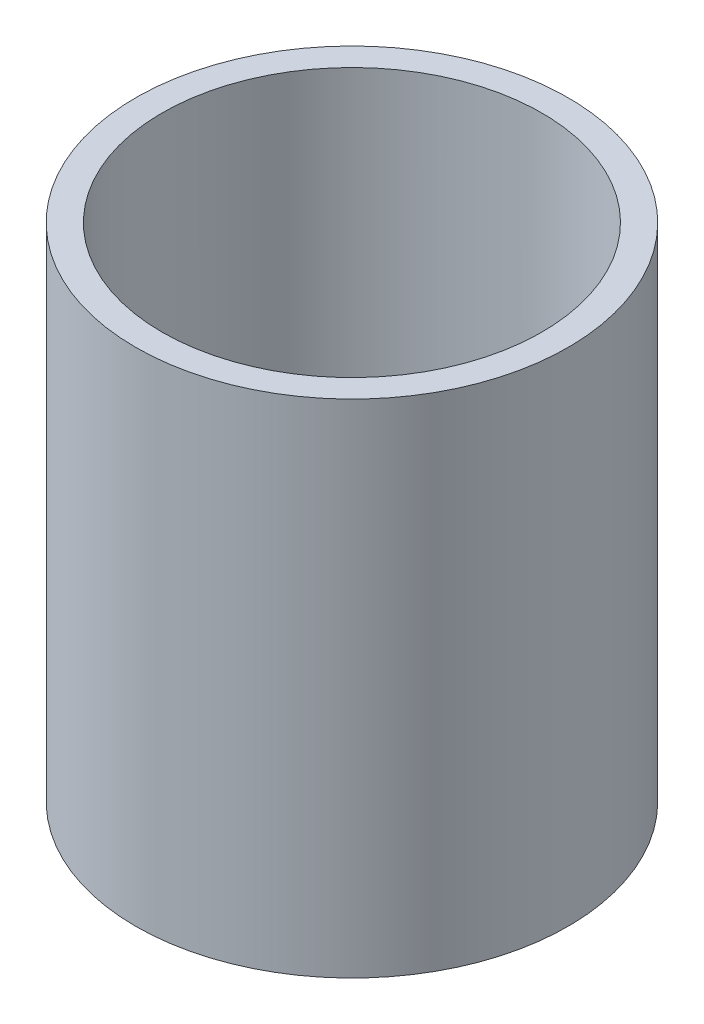
ISO-10303-21;
HEADER;
FILE_DESCRIPTION(('STEP AP214'),'2;1');
FILE_NAME('part.step','',(''),(''),'','','');
FILE_SCHEMA(('AUTOMOTIVE_DESIGN { 1 0 10303 214 1 1 1 1 }'));
ENDSEC;
DATA;
#1=APPLICATION_CONTEXT('core data for automotive mechanical design processes');
#2=APPLICATION_PROTOCOL_DEFINITION('international standard','automotive_design',2000,#1);
#3=PRODUCT_CONTEXT('',#1,'mechanical');
#4=PRODUCT('Part','Part','',(#3));
#5=PRODUCT_RELATED_PRODUCT_CATEGORY('part','',(#4));
#6=PRODUCT_DEFINITION_FORMATION('','',#4);
#7=PRODUCT_DEFINITION_CONTEXT('part definition',#1,'design');
#8=PRODUCT_DEFINITION('design','',#6,#7);
#9=PRODUCT_DEFINITION_SHAPE('','',#8);
#10=(LENGTH_UNIT() NAMED_UNIT(*) SI_UNIT(.MILLI.,.METRE.));
#11=(NAMED_UNIT(*) PLANE_ANGLE_UNIT() SI_UNIT($,.RADIAN.));
#12=(NAMED_UNIT(*) SI_UNIT($,.STERADIAN.) SOLID_ANGLE_UNIT());
#13=UNCERTAINTY_MEASURE_WITH_UNIT(LENGTH_MEASURE(1.E-05),#10,'distance_accuracy_value','');
#14=(GEOMETRIC_REPRESENTATION_CONTEXT(3) GLOBAL_UNCERTAINTY_ASSIGNED_CONTEXT((#13)) GLOBAL_UNIT_ASSIGNED_CONTEXT((#10,
#11,#12)) REPRESENTATION_CONTEXT('',''));
#15=CARTESIAN_POINT('',(0.,0.,0.));
#16=DIRECTION('',(0.,0.,1.));
#17=DIRECTION('',(1.,0.,0.));
#18=AXIS2_PLACEMENT_3D('',#15,#16,#17);
#19=CARTESIAN_POINT('',(0.,8.,0.));
#20=DIRECTION('',(0.,1.,0.));
#21=DIRECTION('',(0.,0.,1.));
#22=AXIS2_PLACEMENT_3D('',#19,#20,#21);
#23=PLANE('',#22);
#24=DIRECTION('',(0.866025403784439,0.,-0.499999999999999));
#25=VECTOR('',#24,1.);
#26=CARTESIAN_POINT('',(0.,8.,33.3274990747593));
#27=LINE('',#26,#25);
#28=CARTESIAN_POINT('',(0.,8.,33.3274990747593));
#29=VERTEX_POINT('',#28);
#30=CARTESIAN_POINT('',(2.925,8.,31.6387495373797));
#31=VERTEX_POINT('',#30);
#32=EDGE_CURVE('E222',#29,#31,#27,.T.);
#33=ORIENTED_EDGE('',*,*,#32,.F.);
#34=CARTESIAN_POINT('',(0.,8.,0.));
#35=DIRECTION('',(0.,1.,0.));
#36=DIRECTION('',(0.,0.,1.));
#37=AXIS2_PLACEMENT_3D('',#34,#35,#36);
#38=CIRCLE('',#37,33.3274990747593);
#39=CARTESIAN_POINT('',(33.3274990747593,8.,0.));
#40=VERTEX_POINT('',#39);
#41=EDGE_CURVE('E55',#29,#40,#38,.T.);
#42=ORIENTED_EDGE('',*,*,#41,.T.);
#43=DIRECTION('',(0.5,0.,-0.866025403784439));
#44=VECTOR('',#43,1.);
#45=CARTESIAN_POINT('',(31.6387495373797,8.,2.92500000000001));
#46=LINE('',#45,#44);
#47=CARTESIAN_POINT('',(31.6387495373797,8.,2.92500000000001));
#48=VERTEX_POINT('',#47);
#49=EDGE_CURVE('E219',#48,#40,#46,.T.);
#50=ORIENTED_EDGE('',*,*,#49,.F.);
#51=DIRECTION('',(1.,0.,0.));
#52=VECTOR('',#51,1.);
#53=CARTESIAN_POINT('',(28.2612504626204,8.,2.925));
#54=LINE('',#53,#52);
#55=CARTESIAN_POINT('',(28.2612504626204,8.,2.925));
#56=VERTEX_POINT('',#55);
#57=EDGE_CURVE('E245',#56,#48,#54,.T.);
#58=ORIENTED_EDGE('',*,*,#57,.F.);
#59=DIRECTION('',(0.499999999999999,0.,0.866025403784439));
#60=VECTOR('',#59,1.);
#61=CARTESIAN_POINT('',(26.5725009252407,8.,0.));
#62=LINE('',#61,#60);
#63=CARTESIAN_POINT('',(26.5725009252407,8.,0.));
#64=VERTEX_POINT('',#63);
#65=EDGE_CURVE('E258',#64,#56,#62,.T.);
#66=ORIENTED_EDGE('',*,*,#65,.F.);
#67=DIRECTION('',(-0.500000000000001,0.,0.866025403784438));
#68=VECTOR('',#67,1.);
#69=CARTESIAN_POINT('',(28.2612504626204,8.,-2.925));
#70=LINE('',#69,#68);
#71=CARTESIAN_POINT('',(28.2612504626204,8.,-2.925));
#72=VERTEX_POINT('',#71);
#73=EDGE_CURVE('E70',#72,#64,#70,.T.);
#74=ORIENTED_EDGE('',*,*,#73,.F.);
#75=DIRECTION('',(-1.,0.,0.));
#76=VECTOR('',#75,1.);
#77=CARTESIAN_POINT('',(31.6387495373797,8.,-2.92499999999999));
#78=LINE('',#77,#76);
#79=CARTESIAN_POINT('',(31.6387495373797,8.,-2.92499999999999));
#80=VERTEX_POINT('',#79);
#81=EDGE_CURVE('E248',#80,#72,#78,.T.);
#82=ORIENTED_EDGE('',*,*,#81,.F.);
#83=DIRECTION('',(-0.499999999999999,0.,-0.866025403784439));
#84=VECTOR('',#83,1.);
#85=CARTESIAN_POINT('',(33.3274990747593,8.,0.));
#86=LINE('',#85,#84);
#87=EDGE_CURVE('E231',#40,#80,#86,.T.);
#88=ORIENTED_EDGE('',*,*,#87,.F.);
#89=CARTESIAN_POINT('',(0.,8.,-33.3274990747593));
#90=VERTEX_POINT('',#89);
#91=EDGE_CURVE('E11',#40,#90,#38,.T.);
#92=ORIENTED_EDGE('',*,*,#91,.T.);
#93=DIRECTION('',(-0.866025403784437,0.,-0.500000000000003));
#94=VECTOR('',#93,1.);
#95=CARTESIAN_POINT('',(2.92500000000001,8.,-31.6387495373797));
#96=LINE('',#95,#94);
#97=CARTESIAN_POINT('',(2.92500000000001,8.,-31.6387495373797));
#98=VERTEX_POINT('',#97);
#99=EDGE_CURVE('E540',#98,#90,#96,.T.);
#100=ORIENTED_EDGE('',*,*,#99,.F.);
#101=DIRECTION('',(0.,0.,-1.));
#102=VECTOR('',#101,1.);
#103=CARTESIAN_POINT('',(2.925,8.,-28.2612504626203));
#104=LINE('',#103,#102);
#105=CARTESIAN_POINT('',(2.925,8.,-28.2612504626203));
#106=VERTEX_POINT('',#105);
#107=EDGE_CURVE('E536',#106,#98,#104,.T.);
#108=ORIENTED_EDGE('',*,*,#107,.F.);
#109=DIRECTION('',(0.866025403784441,0.,-0.499999999999996));
#110=VECTOR('',#109,1.);
#111=CARTESIAN_POINT('',(0.,8.,-26.5725009252407));
#112=LINE('',#111,#110);
#113=CARTESIAN_POINT('',(0.,8.,-26.5725009252407));
#114=VERTEX_POINT('',#113);
#115=EDGE_CURVE('E532',#114,#106,#112,.T.);
#116=ORIENTED_EDGE('',*,*,#115,.F.);
#117=DIRECTION('',(0.866025403784438,0.,0.500000000000001));
#118=VECTOR('',#117,1.);
#119=CARTESIAN_POINT('',(-2.925,8.,-28.2612504626204));
#120=LINE('',#119,#118);
#121=CARTESIAN_POINT('',(-2.925,8.,-28.2612504626204));
#122=VERTEX_POINT('',#121);
#123=EDGE_CURVE('E62',#122,#114,#120,.T.);
#124=ORIENTED_EDGE('',*,*,#123,.F.);
#125=DIRECTION('',(0.,0.,1.));
#126=VECTOR('',#125,1.);
#127=CARTESIAN_POINT('',(-2.92499999999999,8.,-31.6387495373797));
#128=LINE('',#127,#126);
#129=CARTESIAN_POINT('',(-2.92499999999999,8.,-31.6387495373797));
#130=VERTEX_POINT('',#129);
#131=EDGE_CURVE('E509',#130,#122,#128,.T.);
#132=ORIENTED_EDGE('',*,*,#131,.F.);
#133=DIRECTION('',(-0.86602540378444,0.,0.499999999999997));
#134=VECTOR('',#133,1.);
#135=CARTESIAN_POINT('',(0.,8.,-33.3274990747593));
#136=LINE('',#135,#134);
#137=EDGE_CURVE('E544',#90,#130,#136,.T.);
#138=ORIENTED_EDGE('',*,*,#137,.F.);
#139=CARTESIAN_POINT('',(-33.3274990747593,8.,0.));
#140=VERTEX_POINT('',#139);
#141=EDGE_CURVE('E53',#90,#140,#38,.T.);
#142=ORIENTED_EDGE('',*,*,#141,.T.);
#143=DIRECTION('',(-0.5,0.,0.866025403784439));
#144=VECTOR('',#143,1.);
#145=CARTESIAN_POINT('',(-31.6387495373797,8.,-2.925));
#146=LINE('',#145,#144);
#147=CARTESIAN_POINT('',(-31.6387495373797,8.,-2.925));
#148=VERTEX_POINT('',#147);
#149=EDGE_CURVE('E383',#148,#140,#146,.T.);
#150=ORIENTED_EDGE('',*,*,#149,.F.);
#151=DIRECTION('',(-1.,0.,0.));
#152=VECTOR('',#151,1.);
#153=CARTESIAN_POINT('',(-28.2612504626204,8.,-2.925));
#154=LINE('',#153,#152);
#155=CARTESIAN_POINT('',(-28.2612504626204,8.,-2.925));
#156=VERTEX_POINT('',#155);
#157=EDGE_CURVE('E387',#156,#148,#154,.T.);
#158=ORIENTED_EDGE('',*,*,#157,.F.);
#159=DIRECTION('',(-0.499999999999999,0.,-0.866025403784439));
#160=VECTOR('',#159,1.);
#161=CARTESIAN_POINT('',(-26.5725009252407,8.,0.));
#162=LINE('',#161,#160);
#163=CARTESIAN_POINT('',(-26.5725009252407,8.,0.));
#164=VERTEX_POINT('',#163);
#165=EDGE_CURVE('E391',#164,#156,#162,.T.);
#166=ORIENTED_EDGE('',*,*,#165,.F.);
#167=DIRECTION('',(0.5,0.,-0.866025403784438));
#168=VECTOR('',#167,1.);
#169=CARTESIAN_POINT('',(-28.2612504626204,8.,2.925));
#170=LINE('',#169,#168);
#171=CARTESIAN_POINT('',(-28.2612504626204,8.,2.925));
#172=VERTEX_POINT('',#171);
#173=EDGE_CURVE('E306',#172,#164,#170,.T.);
#174=ORIENTED_EDGE('',*,*,#173,.F.);
#175=DIRECTION('',(1.,0.,0.));
#176=VECTOR('',#175,1.);
#177=CARTESIAN_POINT('',(-31.6387495373797,8.,2.925));
#178=LINE('',#177,#176);
#179=CARTESIAN_POINT('',(-31.6387495373797,8.,2.925));
#180=VERTEX_POINT('',#179);
#181=EDGE_CURVE('E374',#180,#172,#178,.T.);
#182=ORIENTED_EDGE('',*,*,#181,.F.);
#183=DIRECTION('',(0.499999999999999,0.,0.866025403784439));
#184=VECTOR('',#183,1.);
#185=CARTESIAN_POINT('',(-33.3274990747593,8.,0.));
#186=LINE('',#185,#184);
#187=EDGE_CURVE('E378',#140,#180,#186,.T.);
#188=ORIENTED_EDGE('',*,*,#187,.F.);
#189=EDGE_CURVE('E225',#140,#29,#38,.T.);
#190=ORIENTED_EDGE('',*,*,#189,.T.);
#191=DIRECTION('',(0.866025403784438,0.,0.5));
#192=VECTOR('',#191,1.);
#193=CARTESIAN_POINT('',(-2.925,8.,31.6387495373797));
#194=LINE('',#193,#192);
#195=CARTESIAN_POINT('',(-2.925,8.,31.6387495373797));
#196=VERTEX_POINT('',#195);
#197=EDGE_CURVE('E314',#196,#29,#194,.T.);
#198=ORIENTED_EDGE('',*,*,#197,.F.);
#199=DIRECTION('',(0.,0.,1.));
#200=VECTOR('',#199,1.);
#201=CARTESIAN_POINT('',(-2.925,8.,28.2612504626204));
#202=LINE('',#201,#200);
#203=CARTESIAN_POINT('',(-2.925,8.,28.2612504626204));
#204=VERTEX_POINT('',#203);
#205=EDGE_CURVE('E318',#204,#196,#202,.T.);
#206=ORIENTED_EDGE('',*,*,#205,.F.);
#207=DIRECTION('',(-0.866025403784439,0.,0.499999999999999));
#208=VECTOR('',#207,1.);
#209=CARTESIAN_POINT('',(0.,8.,26.5725009252407));
#210=LINE('',#209,#208);
#211=CARTESIAN_POINT('',(0.,8.,26.5725009252407));
#212=VERTEX_POINT('',#211);
#213=EDGE_CURVE('E322',#212,#204,#210,.T.);
#214=ORIENTED_EDGE('',*,*,#213,.F.);
#215=DIRECTION('',(-0.866025403784438,0.,-0.500000000000001));
#216=VECTOR('',#215,1.);
#217=CARTESIAN_POINT('',(2.925,8.,28.2612504626204));
#218=LINE('',#217,#216);
#219=CARTESIAN_POINT('',(2.925,8.,28.2612504626204));
#220=VERTEX_POINT('',#219);
#221=EDGE_CURVE('E326',#220,#212,#218,.T.);
#222=ORIENTED_EDGE('',*,*,#221,.F.);
#223=DIRECTION('',(0.,0.,-1.));
#224=VECTOR('',#223,1.);
#225=CARTESIAN_POINT('',(2.925,8.,31.6387495373797));
#226=LINE('',#225,#224);
#227=EDGE_CURVE('E307',#31,#220,#226,.T.);
#228=ORIENTED_EDGE('',*,*,#227,.F.);
#229=EDGE_LOOP('',(#33,#42,#50,#58,#66,#74,#82,#88,#92,#100,#108,#116,#124,#132,#138,#142,#150,
#158,#166,#174,#182,#188,#190,#198,#206,#214,#222,#228));
#230=FACE_BOUND('',#229,.T.);
#231=ADVANCED_FACE('F43',(#230),#23,.T.);
#232=CARTESIAN_POINT('',(-29.95,0.,0.));
#233=DIRECTION('',(0.,1.,0.));
#234=DIRECTION('',(0.,0.,1.));
#235=AXIS2_PLACEMENT_3D('',#232,#233,#234);
#236=CYLINDRICAL_SURFACE('',#235,1.7);
#237=CARTESIAN_POINT('',(-29.95,0.,0.));
#238=DIRECTION('',(0.,1.,0.));
#239=DIRECTION('',(0.,0.,1.));
#240=AXIS2_PLACEMENT_3D('',#237,#238,#239);
#241=CIRCLE('',#240,1.7);
#242=CARTESIAN_POINT('',(-29.95,0.,1.7));
#243=VERTEX_POINT('',#242);
#244=EDGE_CURVE('E432',#243,#243,#241,.T.);
#245=ORIENTED_EDGE('',*,*,#244,.F.);
#246=EDGE_LOOP('',(#245));
#247=FACE_BOUND('',#246,.T.);
#248=CARTESIAN_POINT('',(-29.95,4.,0.));
#249=DIRECTION('',(0.,1.,0.));
#250=DIRECTION('',(0.,0.,1.));
#251=AXIS2_PLACEMENT_3D('',#248,#249,#250);
#252=CIRCLE('',#251,1.7);
#253=CARTESIAN_POINT('',(-29.95,4.,1.7));
#254=VERTEX_POINT('',#253);
#255=EDGE_CURVE('E47',#254,#254,#252,.F.);
#256=ORIENTED_EDGE('',*,*,#255,.F.);
#257=EDGE_LOOP('',(#256));
#258=FACE_BOUND('',#257,.T.);
#259=ADVANCED_FACE('F458',(#247,#258),#236,.F.);
#260=CARTESIAN_POINT('',(0.,0.,29.95));
#261=DIRECTION('',(0.,1.,0.));
#262=DIRECTION('',(0.,0.,1.));
#263=AXIS2_PLACEMENT_3D('',#260,#261,#262);
#264=CYLINDRICAL_SURFACE('',#263,1.7);
#265=CARTESIAN_POINT('',(0.,0.,29.95));
#266=DIRECTION('',(0.,1.,0.));
#267=DIRECTION('',(0.,0.,1.));
#268=AXIS2_PLACEMENT_3D('',#265,#266,#267);
#269=CIRCLE('',#268,1.7);
#270=CARTESIAN_POINT('',(0.,0.,31.65));
#271=VERTEX_POINT('',#270);
#272=EDGE_CURVE('E428',#271,#271,#269,.T.);
#273=ORIENTED_EDGE('',*,*,#272,.F.);
#274=EDGE_LOOP('',(#273));
#275=FACE_BOUND('',#274,.T.);
#276=CARTESIAN_POINT('',(0.,4.,29.95));
#277=DIRECTION('',(0.,1.,0.));
#278=DIRECTION('',(0.,0.,1.));
#279=AXIS2_PLACEMENT_3D('',#276,#277,#278);
#280=CIRCLE('',#279,1.7);
#281=CARTESIAN_POINT('',(0.,4.,31.65));
#282=VERTEX_POINT('',#281);
#283=EDGE_CURVE('E447',#282,#282,#280,.F.);
#284=ORIENTED_EDGE('',*,*,#283,.F.);
#285=EDGE_LOOP('',(#284));
#286=FACE_BOUND('',#285,.T.);
#287=ADVANCED_FACE('F460',(#275,#286),#264,.F.);
#288=CARTESIAN_POINT('',(29.95,0.,0.));
#289=DIRECTION('',(0.,1.,0.));
#290=DIRECTION('',(0.,0.,1.));
#291=AXIS2_PLACEMENT_3D('',#288,#289,#290);
#292=CYLINDRICAL_SURFACE('',#291,1.7);
#293=CARTESIAN_POINT('',(29.95,0.,0.));
#294=DIRECTION('',(0.,1.,0.));
#295=DIRECTION('',(0.,0.,1.));
#296=AXIS2_PLACEMENT_3D('',#293,#294,#295);
#297=CIRCLE('',#296,1.7);
#298=CARTESIAN_POINT('',(29.95,0.,1.7));
#299=VERTEX_POINT('',#298);
#300=EDGE_CURVE('E424',#299,#299,#297,.T.);
#301=ORIENTED_EDGE('',*,*,#300,.F.);
#302=EDGE_LOOP('',(#301));
#303=FACE_BOUND('',#302,.T.);
#304=CARTESIAN_POINT('',(29.95,4.,0.));
#305=DIRECTION('',(0.,1.,0.));
#306=DIRECTION('',(0.,0.,1.));
#307=AXIS2_PLACEMENT_3D('',#304,#305,#306);
#308=CIRCLE('',#307,1.7);
#309=CARTESIAN_POINT('',(29.95,4.,1.7));
#310=VERTEX_POINT('',#309);
#311=EDGE_CURVE('E443',#310,#310,#308,.F.);
#312=ORIENTED_EDGE('',*,*,#311,.F.);
#313=EDGE_LOOP('',(#312));
#314=FACE_BOUND('',#313,.T.);
#315=ADVANCED_FACE('F467',(#303,#314),#292,.F.);
#316=CARTESIAN_POINT('',(0.,0.,-29.95));
#317=DIRECTION('',(0.,1.,0.));
#318=DIRECTION('',(0.,0.,1.));
#319=AXIS2_PLACEMENT_3D('',#316,#317,#318);
#320=CYLINDRICAL_SURFACE('',#319,1.7);
#321=CARTESIAN_POINT('',(0.,0.,-29.95));
#322=DIRECTION('',(0.,1.,0.));
#323=DIRECTION('',(0.,0.,1.));
#324=AXIS2_PLACEMENT_3D('',#321,#322,#323);
#325=CIRCLE('',#324,1.7);
#326=CARTESIAN_POINT('',(0.,0.,-28.25));
#327=VERTEX_POINT('',#326);
#328=EDGE_CURVE('E419',#327,#327,#325,.T.);
#329=ORIENTED_EDGE('',*,*,#328,.F.);
#330=EDGE_LOOP('',(#329));
#331=FACE_BOUND('',#330,.T.);
#332=CARTESIAN_POINT('',(0.,4.,-29.95));
#333=DIRECTION('',(0.,1.,0.));
#334=DIRECTION('',(0.,0.,1.));
#335=AXIS2_PLACEMENT_3D('',#332,#333,#334);
#336=CIRCLE('',#335,1.7);
#337=CARTESIAN_POINT('',(0.,4.,-28.25));
#338=VERTEX_POINT('',#337);
#339=EDGE_CURVE('E439',#338,#338,#336,.F.);
#340=ORIENTED_EDGE('',*,*,#339,.F.);
#341=EDGE_LOOP('',(#340));
#342=FACE_BOUND('',#341,.T.);
#343=ADVANCED_FACE('F484',(#331,#342),#320,.F.);
#344=CARTESIAN_POINT('',(0.,8.,0.));
#345=DIRECTION('',(0.,-1.,0.));
#346=DIRECTION('',(0.,0.,-1.));
#347=AXIS2_PLACEMENT_3D('',#344,#345,#346);
#348=CYLINDRICAL_SURFACE('',#347,37.95);
#349=CARTESIAN_POINT('',(0.,0.,0.));
#350=DIRECTION('',(0.,1.,0.));
#351=DIRECTION('',(0.,0.,1.));
#352=AXIS2_PLACEMENT_3D('',#349,#350,#351);
#353=CIRCLE('',#352,37.95);
#354=CARTESIAN_POINT('',(0.,0.,37.95));
#355=VERTEX_POINT('',#354);
#356=EDGE_CURVE('E423',#355,#355,#353,.T.);
#357=ORIENTED_EDGE('',*,*,#356,.T.);
#358=EDGE_LOOP('',(#357));
#359=FACE_BOUND('',#358,.T.);
#360=CARTESIAN_POINT('',(0.,88.,0.));
#361=DIRECTION('',(0.,1.,0.));
#362=DIRECTION('',(0.,0.,1.));
#363=AXIS2_PLACEMENT_3D('',#360,#361,#362);
#364=CIRCLE('',#363,37.95);
#365=CARTESIAN_POINT('',(0.,88.,37.95));
#366=VERTEX_POINT('',#365);
#367=EDGE_CURVE('E373',#366,#366,#364,.T.);
#368=ORIENTED_EDGE('',*,*,#367,.F.);
#369=EDGE_LOOP('',(#368));
#370=FACE_BOUND('',#369,.T.);
#371=ADVANCED_FACE('F45',(#359,#370),#348,.T.);
#372=CARTESIAN_POINT('',(0.,0.,0.));
#373=DIRECTION('',(0.,1.,0.));
#374=DIRECTION('',(0.,0.,1.));
#375=AXIS2_PLACEMENT_3D('',#372,#373,#374);
#376=PLANE('',#375);
#377=ORIENTED_EDGE('',*,*,#328,.T.);
#378=EDGE_LOOP('',(#377));
#379=FACE_BOUND('',#378,.T.);
#380=ORIENTED_EDGE('',*,*,#300,.T.);
#381=EDGE_LOOP('',(#380));
#382=FACE_BOUND('',#381,.T.);
#383=ORIENTED_EDGE('',*,*,#272,.T.);
#384=EDGE_LOOP('',(#383));
#385=FACE_BOUND('',#384,.T.);
#386=ORIENTED_EDGE('',*,*,#244,.T.);
#387=EDGE_LOOP('',(#386));
#388=FACE_BOUND('',#387,.T.);
#389=ORIENTED_EDGE('',*,*,#356,.F.);
#390=EDGE_LOOP('',(#389));
#391=FACE_BOUND('',#390,.T.);
#392=ADVANCED_FACE('F473',(#379,#382,#385,#388,#391),#376,.F.);
#393=CARTESIAN_POINT('',(0.,4.,0.));
#394=DIRECTION('',(0.,1.,0.));
#395=DIRECTION('',(0.,0.,1.));
#396=AXIS2_PLACEMENT_3D('',#393,#394,#395);
#397=PLANE('',#396);
#398=DIRECTION('',(0.866025403784438,0.,0.500000000000001));
#399=VECTOR('',#398,1.);
#400=CARTESIAN_POINT('',(-2.925,4.,-28.2612504626204));
#401=LINE('',#400,#399);
#402=CARTESIAN_POINT('',(-2.925,4.,-28.2612504626204));
#403=VERTEX_POINT('',#402);
#404=CARTESIAN_POINT('',(0.,4.,-26.5725009252407));
#405=VERTEX_POINT('',#404);
#406=EDGE_CURVE('E504',#403,#405,#401,.T.);
#407=ORIENTED_EDGE('',*,*,#406,.T.);
#408=DIRECTION('',(0.866025403784441,0.,-0.499999999999996));
#409=VECTOR('',#408,1.);
#410=CARTESIAN_POINT('',(0.,4.,-26.5725009252407));
#411=LINE('',#410,#409);
#412=CARTESIAN_POINT('',(2.925,4.,-28.2612504626203));
#413=VERTEX_POINT('',#412);
#414=EDGE_CURVE('E508',#405,#413,#411,.T.);
#415=ORIENTED_EDGE('',*,*,#414,.T.);
#416=DIRECTION('',(0.,0.,-1.));
#417=VECTOR('',#416,1.);
#418=CARTESIAN_POINT('',(2.925,4.,-28.2612504626203));
#419=LINE('',#418,#417);
#420=CARTESIAN_POINT('',(2.92500000000001,4.,-31.6387495373797));
#421=VERTEX_POINT('',#420);
#422=EDGE_CURVE('E513',#413,#421,#419,.T.);
#423=ORIENTED_EDGE('',*,*,#422,.T.);
#424=DIRECTION('',(-0.866025403784437,0.,-0.500000000000003));
#425=VECTOR('',#424,1.);
#426=CARTESIAN_POINT('',(2.92500000000001,4.,-31.6387495373797));
#427=LINE('',#426,#425);
#428=CARTESIAN_POINT('',(0.,4.,-33.3274990747593));
#429=VERTEX_POINT('',#428);
#430=EDGE_CURVE('E517',#421,#429,#427,.T.);
#431=ORIENTED_EDGE('',*,*,#430,.T.);
#432=DIRECTION('',(-0.86602540378444,0.,0.499999999999997));
#433=VECTOR('',#432,1.);
#434=CARTESIAN_POINT('',(0.,4.,-33.3274990747593));
#435=LINE('',#434,#433);
#436=CARTESIAN_POINT('',(-2.92499999999999,4.,-31.6387495373797));
#437=VERTEX_POINT('',#436);
#438=EDGE_CURVE('E521',#429,#437,#435,.T.);
#439=ORIENTED_EDGE('',*,*,#438,.T.);
#440=DIRECTION('',(0.,0.,1.));
#441=VECTOR('',#440,1.);
#442=CARTESIAN_POINT('',(-2.92499999999999,4.,-31.6387495373797));
#443=LINE('',#442,#441);
#444=EDGE_CURVE('E525',#437,#403,#443,.T.);
#445=ORIENTED_EDGE('',*,*,#444,.T.);
#446=EDGE_LOOP('',(#407,#415,#423,#431,#439,#445));
#447=FACE_BOUND('',#446,.T.);
#448=ORIENTED_EDGE('',*,*,#339,.T.);
#449=EDGE_LOOP('',(#448));
#450=FACE_BOUND('',#449,.T.);
#451=ADVANCED_FACE('F475',(#447,#450),#397,.T.);
#452=CARTESIAN_POINT('',(-2.925,4.,-28.2612504626204));
#453=DIRECTION('',(-0.500000000000001,0.,0.866025403784438));
#454=DIRECTION('',(0.866025403784438,0.,0.500000000000001));
#455=AXIS2_PLACEMENT_3D('',#452,#453,#454);
#456=PLANE('',#455);
#457=ORIENTED_EDGE('',*,*,#123,.T.);
#458=DIRECTION('',(0.,1.,0.));
#459=VECTOR('',#458,1.);
#460=CARTESIAN_POINT('',(0.,4.,-26.5725009252407));
#461=LINE('',#460,#459);
#462=EDGE_CURVE('E529',#405,#114,#461,.T.);
#463=ORIENTED_EDGE('',*,*,#462,.F.);
#464=ORIENTED_EDGE('',*,*,#406,.F.);
#465=DIRECTION('',(0.,1.,0.));
#466=VECTOR('',#465,1.);
#467=CARTESIAN_POINT('',(-2.925,4.,-28.2612504626204));
#468=LINE('',#467,#466);
#469=EDGE_CURVE('E444',#403,#122,#468,.T.);
#470=ORIENTED_EDGE('',*,*,#469,.T.);
#471=EDGE_LOOP('',(#457,#463,#464,#470));
#472=FACE_BOUND('',#471,.T.);
#473=ADVANCED_FACE('F481',(#472),#456,.F.);
#474=CARTESIAN_POINT('',(-2.92499999999999,4.,-31.6387495373797));
#475=DIRECTION('',(-1.,0.,0.));
#476=DIRECTION('',(0.,0.,1.));
#477=AXIS2_PLACEMENT_3D('',#474,#475,#476);
#478=PLANE('',#477);
#479=ORIENTED_EDGE('',*,*,#131,.T.);
#480=ORIENTED_EDGE('',*,*,#469,.F.);
#481=ORIENTED_EDGE('',*,*,#444,.F.);
#482=DIRECTION('',(0.,1.,0.));
#483=VECTOR('',#482,1.);
#484=CARTESIAN_POINT('',(-2.92499999999999,4.,-31.6387495373797));
#485=LINE('',#484,#483);
#486=EDGE_CURVE('E553',#437,#130,#485,.T.);
#487=ORIENTED_EDGE('',*,*,#486,.T.);
#488=EDGE_LOOP('',(#479,#480,#481,#487));
#489=FACE_BOUND('',#488,.T.);
#490=ADVANCED_FACE('F701',(#489),#478,.F.);
#491=CARTESIAN_POINT('',(0.,4.,-33.3274990747593));
#492=DIRECTION('',(-0.499999999999997,0.,-0.86602540378444));
#493=DIRECTION('',(-0.86602540378444,0.,0.499999999999997));
#494=AXIS2_PLACEMENT_3D('',#491,#492,#493);
#495=PLANE('',#494);
#496=ORIENTED_EDGE('',*,*,#137,.T.);
#497=ORIENTED_EDGE('',*,*,#486,.F.);
#498=ORIENTED_EDGE('',*,*,#438,.F.);
#499=DIRECTION('',(0.,1.,0.));
#500=VECTOR('',#499,1.);
#501=CARTESIAN_POINT('',(0.,4.,-33.3274990747593));
#502=LINE('',#501,#500);
#503=EDGE_CURVE('E556',#429,#90,#502,.T.);
#504=ORIENTED_EDGE('',*,*,#503,.T.);
#505=EDGE_LOOP('',(#496,#497,#498,#504));
#506=FACE_BOUND('',#505,.T.);
#507=ADVANCED_FACE('F695',(#506),#495,.F.);
#508=CARTESIAN_POINT('',(2.92500000000001,4.,-31.6387495373797));
#509=DIRECTION('',(0.500000000000003,0.,-0.866025403784437));
#510=DIRECTION('',(-0.866025403784437,0.,-0.500000000000003));
#511=AXIS2_PLACEMENT_3D('',#508,#509,#510);
#512=PLANE('',#511);
#513=ORIENTED_EDGE('',*,*,#99,.T.);
#514=ORIENTED_EDGE('',*,*,#503,.F.);
#515=ORIENTED_EDGE('',*,*,#430,.F.);
#516=DIRECTION('',(0.,1.,0.));
#517=VECTOR('',#516,1.);
#518=CARTESIAN_POINT('',(2.92500000000001,4.,-31.6387495373797));
#519=LINE('',#518,#517);
#520=EDGE_CURVE('E559',#421,#98,#519,.T.);
#521=ORIENTED_EDGE('',*,*,#520,.T.);
#522=EDGE_LOOP('',(#513,#514,#515,#521));
#523=FACE_BOUND('',#522,.T.);
#524=ADVANCED_FACE('F700',(#523),#512,.F.);
#525=CARTESIAN_POINT('',(2.925,4.,-28.2612504626203));
#526=DIRECTION('',(1.,0.,0.));
#527=DIRECTION('',(0.,0.,-1.));
#528=AXIS2_PLACEMENT_3D('',#525,#526,#527);
#529=PLANE('',#528);
#530=ORIENTED_EDGE('',*,*,#107,.T.);
#531=ORIENTED_EDGE('',*,*,#520,.F.);
#532=ORIENTED_EDGE('',*,*,#422,.F.);
#533=DIRECTION('',(0.,1.,0.));
#534=VECTOR('',#533,1.);
#535=CARTESIAN_POINT('',(2.925,4.,-28.2612504626203));
#536=LINE('',#535,#534);
#537=EDGE_CURVE('E562',#413,#106,#536,.T.);
#538=ORIENTED_EDGE('',*,*,#537,.T.);
#539=EDGE_LOOP('',(#530,#531,#532,#538));
#540=FACE_BOUND('',#539,.T.);
#541=ADVANCED_FACE('F714',(#540),#529,.F.);
#542=CARTESIAN_POINT('',(0.,4.,-26.5725009252407));
#543=DIRECTION('',(0.499999999999996,0.,0.866025403784441));
#544=DIRECTION('',(0.866025403784441,0.,-0.499999999999996));
#545=AXIS2_PLACEMENT_3D('',#542,#543,#544);
#546=PLANE('',#545);
#547=ORIENTED_EDGE('',*,*,#115,.T.);
#548=ORIENTED_EDGE('',*,*,#537,.F.);
#549=ORIENTED_EDGE('',*,*,#414,.F.);
#550=ORIENTED_EDGE('',*,*,#462,.T.);
#551=EDGE_LOOP('',(#547,#548,#549,#550));
#552=FACE_BOUND('',#551,.T.);
#553=ADVANCED_FACE('F608',(#552),#546,.F.);
#554=CARTESIAN_POINT('',(0.,4.,0.));
#555=DIRECTION('',(0.,1.,0.));
#556=DIRECTION('',(0.,0.,1.));
#557=AXIS2_PLACEMENT_3D('',#554,#555,#556);
#558=PLANE('',#557);
#559=DIRECTION('',(-0.500000000000001,0.,0.866025403784438));
#560=VECTOR('',#559,1.);
#561=CARTESIAN_POINT('',(28.2612504626204,4.,-2.925));
#562=LINE('',#561,#560);
#563=CARTESIAN_POINT('',(28.2612504626204,4.,-2.925));
#564=VERTEX_POINT('',#563);
#565=CARTESIAN_POINT('',(26.5725009252407,4.,0.));
#566=VERTEX_POINT('',#565);
#567=EDGE_CURVE('E252',#564,#566,#562,.T.);
#568=ORIENTED_EDGE('',*,*,#567,.T.);
#569=DIRECTION('',(0.499999999999999,0.,0.866025403784439));
#570=VECTOR('',#569,1.);
#571=CARTESIAN_POINT('',(26.5725009252407,4.,0.));
#572=LINE('',#571,#570);
#573=CARTESIAN_POINT('',(28.2612504626204,4.,2.925));
#574=VERTEX_POINT('',#573);
#575=EDGE_CURVE('E278',#566,#574,#572,.T.);
#576=ORIENTED_EDGE('',*,*,#575,.T.);
#577=DIRECTION('',(1.,0.,0.));
#578=VECTOR('',#577,1.);
#579=CARTESIAN_POINT('',(28.2612504626204,4.,2.925));
#580=LINE('',#579,#578);
#581=CARTESIAN_POINT('',(31.6387495373797,4.,2.92500000000001));
#582=VERTEX_POINT('',#581);
#583=EDGE_CURVE('E274',#574,#582,#580,.T.);
#584=ORIENTED_EDGE('',*,*,#583,.T.);
#585=DIRECTION('',(0.5,0.,-0.866025403784439));
#586=VECTOR('',#585,1.);
#587=CARTESIAN_POINT('',(31.6387495373797,4.,2.92500000000001));
#588=LINE('',#587,#586);
#589=CARTESIAN_POINT('',(33.3274990747593,4.,0.));
#590=VERTEX_POINT('',#589);
#591=EDGE_CURVE('E271',#582,#590,#588,.T.);
#592=ORIENTED_EDGE('',*,*,#591,.T.);
#593=DIRECTION('',(-0.499999999999999,0.,-0.866025403784439));
#594=VECTOR('',#593,1.);
#595=CARTESIAN_POINT('',(33.3274990747593,4.,0.));
#596=LINE('',#595,#594);
#597=CARTESIAN_POINT('',(31.6387495373797,4.,-2.92499999999999));
#598=VERTEX_POINT('',#597);
#599=EDGE_CURVE('E234',#590,#598,#596,.T.);
#600=ORIENTED_EDGE('',*,*,#599,.T.);
#601=DIRECTION('',(-1.,0.,0.));
#602=VECTOR('',#601,1.);
#603=CARTESIAN_POINT('',(31.6387495373797,4.,-2.92499999999999));
#604=LINE('',#603,#602);
#605=EDGE_CURVE('E264',#598,#564,#604,.T.);
#606=ORIENTED_EDGE('',*,*,#605,.T.);
#607=EDGE_LOOP('',(#568,#576,#584,#592,#600,#606));
#608=FACE_BOUND('',#607,.T.);
#609=ORIENTED_EDGE('',*,*,#311,.T.);
#610=EDGE_LOOP('',(#609));
#611=FACE_BOUND('',#610,.T.);
#612=ADVANCED_FACE('F587',(#608,#611),#558,.T.);
#613=CARTESIAN_POINT('',(28.2612504626204,4.,-2.925));
#614=DIRECTION('',(-0.866025403784438,0.,-0.500000000000001));
#615=DIRECTION('',(-0.500000000000001,0.,0.866025403784438));
#616=AXIS2_PLACEMENT_3D('',#613,#614,#615);
#617=PLANE('',#616);
#618=ORIENTED_EDGE('',*,*,#73,.T.);
#619=DIRECTION('',(0.,1.,0.));
#620=VECTOR('',#619,1.);
#621=CARTESIAN_POINT('',(26.5725009252407,4.,0.));
#622=LINE('',#621,#620);
#623=EDGE_CURVE('E268',#566,#64,#622,.T.);
#624=ORIENTED_EDGE('',*,*,#623,.F.);
#625=ORIENTED_EDGE('',*,*,#567,.F.);
#626=DIRECTION('',(0.,1.,0.));
#627=VECTOR('',#626,1.);
#628=CARTESIAN_POINT('',(28.2612504626204,4.,-2.925));
#629=LINE('',#628,#627);
#630=EDGE_CURVE('E329',#564,#72,#629,.T.);
#631=ORIENTED_EDGE('',*,*,#630,.T.);
#632=EDGE_LOOP('',(#618,#624,#625,#631));
#633=FACE_BOUND('',#632,.T.);
#634=ADVANCED_FACE('F577',(#633),#617,.F.);
#635=CARTESIAN_POINT('',(31.6387495373797,4.,-2.92499999999999));
#636=DIRECTION('',(0.,0.,-1.));
#637=DIRECTION('',(-1.,0.,0.));
#638=AXIS2_PLACEMENT_3D('',#635,#636,#637);
#639=PLANE('',#638);
#640=ORIENTED_EDGE('',*,*,#81,.T.);
#641=ORIENTED_EDGE('',*,*,#630,.F.);
#642=ORIENTED_EDGE('',*,*,#605,.F.);
#643=DIRECTION('',(0.,1.,0.));
#644=VECTOR('',#643,1.);
#645=CARTESIAN_POINT('',(31.6387495373797,4.,-2.92499999999999));
#646=LINE('',#645,#644);
#647=EDGE_CURVE('E240',#598,#80,#646,.T.);
#648=ORIENTED_EDGE('',*,*,#647,.T.);
#649=EDGE_LOOP('',(#640,#641,#642,#648));
#650=FACE_BOUND('',#649,.T.);
#651=ADVANCED_FACE('F580',(#650),#639,.F.);
#652=CARTESIAN_POINT('',(33.3274990747593,4.,0.));
#653=DIRECTION('',(0.866025403784439,0.,-0.499999999999999));
#654=DIRECTION('',(-0.499999999999999,0.,-0.866025403784439));
#655=AXIS2_PLACEMENT_3D('',#652,#653,#654);
#656=PLANE('',#655);
#657=ORIENTED_EDGE('',*,*,#87,.T.);
#658=ORIENTED_EDGE('',*,*,#647,.F.);
#659=ORIENTED_EDGE('',*,*,#599,.F.);
#660=DIRECTION('',(0.,1.,0.));
#661=VECTOR('',#660,1.);
#662=CARTESIAN_POINT('',(33.3274990747593,4.,0.));
#663=LINE('',#662,#661);
#664=EDGE_CURVE('E229',#590,#40,#663,.T.);
#665=ORIENTED_EDGE('',*,*,#664,.T.);
#666=EDGE_LOOP('',(#657,#658,#659,#665));
#667=FACE_BOUND('',#666,.T.);
#668=ADVANCED_FACE('F230',(#667),#656,.F.);
#669=CARTESIAN_POINT('',(31.6387495373797,4.,2.92500000000001));
#670=DIRECTION('',(0.866025403784439,0.,0.5));
#671=DIRECTION('',(0.5,0.,-0.866025403784439));
#672=AXIS2_PLACEMENT_3D('',#669,#670,#671);
#673=PLANE('',#672);
#674=ORIENTED_EDGE('',*,*,#49,.T.);
#675=ORIENTED_EDGE('',*,*,#664,.F.);
#676=ORIENTED_EDGE('',*,*,#591,.F.);
#677=DIRECTION('',(0.,1.,0.));
#678=VECTOR('',#677,1.);
#679=CARTESIAN_POINT('',(31.6387495373797,4.,2.92500000000001));
#680=LINE('',#679,#678);
#681=EDGE_CURVE('E239',#582,#48,#680,.T.);
#682=ORIENTED_EDGE('',*,*,#681,.T.);
#683=EDGE_LOOP('',(#674,#675,#676,#682));
#684=FACE_BOUND('',#683,.T.);
#685=ADVANCED_FACE('F242',(#684),#673,.F.);
#686=CARTESIAN_POINT('',(28.2612504626204,4.,2.925));
#687=DIRECTION('',(0.,0.,1.));
#688=DIRECTION('',(1.,0.,0.));
#689=AXIS2_PLACEMENT_3D('',#686,#687,#688);
#690=PLANE('',#689);
#691=ORIENTED_EDGE('',*,*,#57,.T.);
#692=ORIENTED_EDGE('',*,*,#681,.F.);
#693=ORIENTED_EDGE('',*,*,#583,.F.);
#694=DIRECTION('',(0.,1.,0.));
#695=VECTOR('',#694,1.);
#696=CARTESIAN_POINT('',(28.2612504626204,4.,2.925));
#697=LINE('',#696,#695);
#698=EDGE_CURVE('E569',#574,#56,#697,.T.);
#699=ORIENTED_EDGE('',*,*,#698,.T.);
#700=EDGE_LOOP('',(#691,#692,#693,#699));
#701=FACE_BOUND('',#700,.T.);
#702=ADVANCED_FACE('F590',(#701),#690,.F.);
#703=CARTESIAN_POINT('',(26.5725009252407,4.,0.));
#704=DIRECTION('',(-0.866025403784439,0.,0.499999999999999));
#705=DIRECTION('',(0.499999999999999,0.,0.866025403784439));
#706=AXIS2_PLACEMENT_3D('',#703,#704,#705);
#707=PLANE('',#706);
#708=ORIENTED_EDGE('',*,*,#65,.T.);
#709=ORIENTED_EDGE('',*,*,#698,.F.);
#710=ORIENTED_EDGE('',*,*,#575,.F.);
#711=ORIENTED_EDGE('',*,*,#623,.T.);
#712=EDGE_LOOP('',(#708,#709,#710,#711));
#713=FACE_BOUND('',#712,.T.);
#714=ADVANCED_FACE('F583',(#713),#707,.F.);
#715=CARTESIAN_POINT('',(0.,4.,0.));
#716=DIRECTION('',(0.,1.,0.));
#717=DIRECTION('',(0.,0.,1.));
#718=AXIS2_PLACEMENT_3D('',#715,#716,#717);
#719=PLANE('',#718);
#720=DIRECTION('',(-0.866025403784438,0.,-0.500000000000001));
#721=VECTOR('',#720,1.);
#722=CARTESIAN_POINT('',(2.925,4.,28.2612504626204));
#723=LINE('',#722,#721);
#724=CARTESIAN_POINT('',(2.925,4.,28.2612504626204));
#725=VERTEX_POINT('',#724);
#726=CARTESIAN_POINT('',(0.,4.,26.5725009252407));
#727=VERTEX_POINT('',#726);
#728=EDGE_CURVE('E311',#725,#727,#723,.T.);
#729=ORIENTED_EDGE('',*,*,#728,.T.);
#730=DIRECTION('',(-0.866025403784439,0.,0.499999999999999));
#731=VECTOR('',#730,1.);
#732=CARTESIAN_POINT('',(0.,4.,26.5725009252407));
#733=LINE('',#732,#731);
#734=CARTESIAN_POINT('',(-2.925,4.,28.2612504626204));
#735=VERTEX_POINT('',#734);
#736=EDGE_CURVE('E345',#727,#735,#733,.T.);
#737=ORIENTED_EDGE('',*,*,#736,.T.);
#738=DIRECTION('',(0.,0.,1.));
#739=VECTOR('',#738,1.);
#740=CARTESIAN_POINT('',(-2.925,4.,28.2612504626204));
#741=LINE('',#740,#739);
#742=CARTESIAN_POINT('',(-2.925,4.,31.6387495373797));
#743=VERTEX_POINT('',#742);
#744=EDGE_CURVE('E341',#735,#743,#741,.T.);
#745=ORIENTED_EDGE('',*,*,#744,.T.);
#746=DIRECTION('',(0.866025403784438,0.,0.5));
#747=VECTOR('',#746,1.);
#748=CARTESIAN_POINT('',(-2.925,4.,31.6387495373797));
#749=LINE('',#748,#747);
#750=CARTESIAN_POINT('',(0.,4.,33.3274990747593));
#751=VERTEX_POINT('',#750);
#752=EDGE_CURVE('E337',#743,#751,#749,.T.);
#753=ORIENTED_EDGE('',*,*,#752,.T.);
#754=DIRECTION('',(0.866025403784439,0.,-0.499999999999999));
#755=VECTOR('',#754,1.);
#756=CARTESIAN_POINT('',(0.,4.,33.3274990747593));
#757=LINE('',#756,#755);
#758=CARTESIAN_POINT('',(2.925,4.,31.6387495373797));
#759=VERTEX_POINT('',#758);
#760=EDGE_CURVE('E333',#751,#759,#757,.T.);
#761=ORIENTED_EDGE('',*,*,#760,.T.);
#762=DIRECTION('',(0.,0.,-1.));
#763=VECTOR('',#762,1.);
#764=CARTESIAN_POINT('',(2.925,4.,31.6387495373797));
#765=LINE('',#764,#763);
#766=EDGE_CURVE('E289',#759,#725,#765,.T.);
#767=ORIENTED_EDGE('',*,*,#766,.T.);
#768=EDGE_LOOP('',(#729,#737,#745,#753,#761,#767));
#769=FACE_BOUND('',#768,.T.);
#770=ORIENTED_EDGE('',*,*,#283,.T.);
#771=EDGE_LOOP('',(#770));
#772=FACE_BOUND('',#771,.T.);
#773=ADVANCED_FACE('F597',(#769,#772),#719,.T.);
#774=CARTESIAN_POINT('',(2.925,4.,28.2612504626204));
#775=DIRECTION('',(0.500000000000001,0.,-0.866025403784438));
#776=DIRECTION('',(-0.866025403784438,0.,-0.500000000000001));
#777=AXIS2_PLACEMENT_3D('',#774,#775,#776);
#778=PLANE('',#777);
#779=ORIENTED_EDGE('',*,*,#221,.T.);
#780=DIRECTION('',(0.,1.,0.));
#781=VECTOR('',#780,1.);
#782=CARTESIAN_POINT('',(0.,4.,26.5725009252407));
#783=LINE('',#782,#781);
#784=EDGE_CURVE('E285',#727,#212,#783,.T.);
#785=ORIENTED_EDGE('',*,*,#784,.F.);
#786=ORIENTED_EDGE('',*,*,#728,.F.);
#787=DIRECTION('',(0.,1.,0.));
#788=VECTOR('',#787,1.);
#789=CARTESIAN_POINT('',(2.925,4.,28.2612504626204));
#790=LINE('',#789,#788);
#791=EDGE_CURVE('E303',#725,#220,#790,.T.);
#792=ORIENTED_EDGE('',*,*,#791,.T.);
#793=EDGE_LOOP('',(#779,#785,#786,#792));
#794=FACE_BOUND('',#793,.T.);
#795=ADVANCED_FACE('F609',(#794),#778,.F.);
#796=CARTESIAN_POINT('',(2.925,4.,31.6387495373797));
#797=DIRECTION('',(1.,0.,0.));
#798=DIRECTION('',(0.,0.,-1.));
#799=AXIS2_PLACEMENT_3D('',#796,#797,#798);
#800=PLANE('',#799);
#801=ORIENTED_EDGE('',*,*,#227,.T.);
#802=ORIENTED_EDGE('',*,*,#791,.F.);
#803=ORIENTED_EDGE('',*,*,#766,.F.);
#804=DIRECTION('',(0.,1.,0.));
#805=VECTOR('',#804,1.);
#806=CARTESIAN_POINT('',(2.925,4.,31.6387495373797));
#807=LINE('',#806,#805);
#808=EDGE_CURVE('E300',#759,#31,#807,.T.);
#809=ORIENTED_EDGE('',*,*,#808,.T.);
#810=EDGE_LOOP('',(#801,#802,#803,#809));
#811=FACE_BOUND('',#810,.T.);
#812=ADVANCED_FACE('F612',(#811),#800,.F.);
#813=CARTESIAN_POINT('',(0.,4.,33.3274990747593));
#814=DIRECTION('',(0.499999999999999,0.,0.866025403784439));
#815=DIRECTION('',(0.866025403784439,0.,-0.499999999999999));
#816=AXIS2_PLACEMENT_3D('',#813,#814,#815);
#817=PLANE('',#816);
#818=ORIENTED_EDGE('',*,*,#32,.T.);
#819=ORIENTED_EDGE('',*,*,#808,.F.);
#820=ORIENTED_EDGE('',*,*,#760,.F.);
#821=DIRECTION('',(0.,1.,0.));
#822=VECTOR('',#821,1.);
#823=CARTESIAN_POINT('',(0.,4.,33.3274990747593));
#824=LINE('',#823,#822);
#825=EDGE_CURVE('E296',#751,#29,#824,.T.);
#826=ORIENTED_EDGE('',*,*,#825,.T.);
#827=EDGE_LOOP('',(#818,#819,#820,#826));
#828=FACE_BOUND('',#827,.T.);
#829=ADVANCED_FACE('F625',(#828),#817,.F.);
#830=CARTESIAN_POINT('',(-2.925,4.,31.6387495373797));
#831=DIRECTION('',(-0.5,0.,0.866025403784438));
#832=DIRECTION('',(0.866025403784438,0.,0.5));
#833=AXIS2_PLACEMENT_3D('',#830,#831,#832);
#834=PLANE('',#833);
#835=ORIENTED_EDGE('',*,*,#197,.T.);
#836=ORIENTED_EDGE('',*,*,#825,.F.);
#837=ORIENTED_EDGE('',*,*,#752,.F.);
#838=DIRECTION('',(0.,1.,0.));
#839=VECTOR('',#838,1.);
#840=CARTESIAN_POINT('',(-2.925,4.,31.6387495373797));
#841=LINE('',#840,#839);
#842=EDGE_CURVE('E293',#743,#196,#841,.T.);
#843=ORIENTED_EDGE('',*,*,#842,.T.);
#844=EDGE_LOOP('',(#835,#836,#837,#843));
#845=FACE_BOUND('',#844,.T.);
#846=ADVANCED_FACE('F621',(#845),#834,.F.);
#847=CARTESIAN_POINT('',(-2.925,4.,28.2612504626204));
#848=DIRECTION('',(-1.,0.,0.));
#849=DIRECTION('',(0.,0.,1.));
#850=AXIS2_PLACEMENT_3D('',#847,#848,#849);
#851=PLANE('',#850);
#852=ORIENTED_EDGE('',*,*,#205,.T.);
#853=ORIENTED_EDGE('',*,*,#842,.F.);
#854=ORIENTED_EDGE('',*,*,#744,.F.);
#855=DIRECTION('',(0.,1.,0.));
#856=VECTOR('',#855,1.);
#857=CARTESIAN_POINT('',(-2.925,4.,28.2612504626204));
#858=LINE('',#857,#856);
#859=EDGE_CURVE('E290',#735,#204,#858,.T.);
#860=ORIENTED_EDGE('',*,*,#859,.T.);
#861=EDGE_LOOP('',(#852,#853,#854,#860));
#862=FACE_BOUND('',#861,.T.);
#863=ADVANCED_FACE('F617',(#862),#851,.F.);
#864=CARTESIAN_POINT('',(0.,4.,26.5725009252407));
#865=DIRECTION('',(-0.499999999999999,0.,-0.866025403784439));
#866=DIRECTION('',(-0.866025403784439,0.,0.499999999999999));
#867=AXIS2_PLACEMENT_3D('',#864,#865,#866);
#868=PLANE('',#867);
#869=ORIENTED_EDGE('',*,*,#213,.T.);
#870=ORIENTED_EDGE('',*,*,#859,.F.);
#871=ORIENTED_EDGE('',*,*,#736,.F.);
#872=ORIENTED_EDGE('',*,*,#784,.T.);
#873=EDGE_LOOP('',(#869,#870,#871,#872));
#874=FACE_BOUND('',#873,.T.);
#875=ADVANCED_FACE('F614',(#874),#868,.F.);
#876=CARTESIAN_POINT('',(0.,4.,0.));
#877=DIRECTION('',(0.,1.,0.));
#878=DIRECTION('',(0.,0.,1.));
#879=AXIS2_PLACEMENT_3D('',#876,#877,#878);
#880=PLANE('',#879);
#881=DIRECTION('',(0.5,0.,-0.866025403784438));
#882=VECTOR('',#881,1.);
#883=CARTESIAN_POINT('',(-28.2612504626204,4.,2.925));
#884=LINE('',#883,#882);
#885=CARTESIAN_POINT('',(-28.2612504626204,4.,2.925));
#886=VERTEX_POINT('',#885);
#887=CARTESIAN_POINT('',(-26.5725009252407,4.,0.));
#888=VERTEX_POINT('',#887);
#889=EDGE_CURVE('E379',#886,#888,#884,.T.);
#890=ORIENTED_EDGE('',*,*,#889,.T.);
#891=DIRECTION('',(-0.499999999999999,0.,-0.866025403784439));
#892=VECTOR('',#891,1.);
#893=CARTESIAN_POINT('',(-26.5725009252407,4.,0.));
#894=LINE('',#893,#892);
#895=CARTESIAN_POINT('',(-28.2612504626204,4.,-2.925));
#896=VERTEX_POINT('',#895);
#897=EDGE_CURVE('E412',#888,#896,#894,.T.);
#898=ORIENTED_EDGE('',*,*,#897,.T.);
#899=DIRECTION('',(-1.,0.,0.));
#900=VECTOR('',#899,1.);
#901=CARTESIAN_POINT('',(-28.2612504626204,4.,-2.925));
#902=LINE('',#901,#900);
#903=CARTESIAN_POINT('',(-31.6387495373797,4.,-2.925));
#904=VERTEX_POINT('',#903);
#905=EDGE_CURVE('E408',#896,#904,#902,.T.);
#906=ORIENTED_EDGE('',*,*,#905,.T.);
#907=DIRECTION('',(-0.5,0.,0.866025403784439));
#908=VECTOR('',#907,1.);
#909=CARTESIAN_POINT('',(-31.6387495373797,4.,-2.925));
#910=LINE('',#909,#908);
#911=CARTESIAN_POINT('',(-33.3274990747593,4.,0.));
#912=VERTEX_POINT('',#911);
#913=EDGE_CURVE('E404',#904,#912,#910,.T.);
#914=ORIENTED_EDGE('',*,*,#913,.T.);
#915=DIRECTION('',(0.499999999999999,0.,0.866025403784439));
#916=VECTOR('',#915,1.);
#917=CARTESIAN_POINT('',(-33.3274990747593,4.,0.));
#918=LINE('',#917,#916);
#919=CARTESIAN_POINT('',(-31.6387495373797,4.,2.925));
#920=VERTEX_POINT('',#919);
#921=EDGE_CURVE('E400',#912,#920,#918,.T.);
#922=ORIENTED_EDGE('',*,*,#921,.T.);
#923=DIRECTION('',(1.,0.,0.));
#924=VECTOR('',#923,1.);
#925=CARTESIAN_POINT('',(-31.6387495373797,4.,2.925));
#926=LINE('',#925,#924);
#927=EDGE_CURVE('E356',#920,#886,#926,.T.);
#928=ORIENTED_EDGE('',*,*,#927,.T.);
#929=EDGE_LOOP('',(#890,#898,#906,#914,#922,#928));
#930=FACE_BOUND('',#929,.T.);
#931=ORIENTED_EDGE('',*,*,#255,.T.);
#932=EDGE_LOOP('',(#931));
#933=FACE_BOUND('',#932,.T.);
#934=ADVANCED_FACE('F456',(#930,#933),#880,.T.);
#935=CARTESIAN_POINT('',(-28.2612504626204,4.,2.925));
#936=DIRECTION('',(0.866025403784438,0.,0.5));
#937=DIRECTION('',(0.5,0.,-0.866025403784438));
#938=AXIS2_PLACEMENT_3D('',#935,#936,#937);
#939=PLANE('',#938);
#940=ORIENTED_EDGE('',*,*,#173,.T.);
#941=DIRECTION('',(0.,1.,0.));
#942=VECTOR('',#941,1.);
#943=CARTESIAN_POINT('',(-26.5725009252407,4.,0.));
#944=LINE('',#943,#942);
#945=EDGE_CURVE('E352',#888,#164,#944,.T.);
#946=ORIENTED_EDGE('',*,*,#945,.F.);
#947=ORIENTED_EDGE('',*,*,#889,.F.);
#948=DIRECTION('',(0.,1.,0.));
#949=VECTOR('',#948,1.);
#950=CARTESIAN_POINT('',(-28.2612504626204,4.,2.925));
#951=LINE('',#950,#949);
#952=EDGE_CURVE('E370',#886,#172,#951,.T.);
#953=ORIENTED_EDGE('',*,*,#952,.T.);
#954=EDGE_LOOP('',(#940,#946,#947,#953));
#955=FACE_BOUND('',#954,.T.);
#956=ADVANCED_FACE('F636',(#955),#939,.F.);
#957=CARTESIAN_POINT('',(-31.6387495373797,4.,2.925));
#958=DIRECTION('',(0.,0.,1.));
#959=DIRECTION('',(1.,0.,0.));
#960=AXIS2_PLACEMENT_3D('',#957,#958,#959);
#961=PLANE('',#960);
#962=ORIENTED_EDGE('',*,*,#181,.T.);
#963=ORIENTED_EDGE('',*,*,#952,.F.);
#964=ORIENTED_EDGE('',*,*,#927,.F.);
#965=DIRECTION('',(0.,1.,0.));
#966=VECTOR('',#965,1.);
#967=CARTESIAN_POINT('',(-31.6387495373797,4.,2.925));
#968=LINE('',#967,#966);
#969=EDGE_CURVE('E367',#920,#180,#968,.T.);
#970=ORIENTED_EDGE('',*,*,#969,.T.);
#971=EDGE_LOOP('',(#962,#963,#964,#970));
#972=FACE_BOUND('',#971,.T.);
#973=ADVANCED_FACE('F639',(#972),#961,.F.);
#974=CARTESIAN_POINT('',(-33.3274990747593,4.,0.));
#975=DIRECTION('',(-0.866025403784439,0.,0.499999999999999));
#976=DIRECTION('',(0.499999999999999,0.,0.866025403784439));
#977=AXIS2_PLACEMENT_3D('',#974,#975,#976);
#978=PLANE('',#977);
#979=ORIENTED_EDGE('',*,*,#187,.T.);
#980=ORIENTED_EDGE('',*,*,#969,.F.);
#981=ORIENTED_EDGE('',*,*,#921,.F.);
#982=DIRECTION('',(0.,1.,0.));
#983=VECTOR('',#982,1.);
#984=CARTESIAN_POINT('',(-33.3274990747593,4.,0.));
#985=LINE('',#984,#983);
#986=EDGE_CURVE('E363',#912,#140,#985,.T.);
#987=ORIENTED_EDGE('',*,*,#986,.T.);
#988=EDGE_LOOP('',(#979,#980,#981,#987));
#989=FACE_BOUND('',#988,.T.);
#990=ADVANCED_FACE('F653',(#989),#978,.F.);
#991=CARTESIAN_POINT('',(-31.6387495373797,4.,-2.925));
#992=DIRECTION('',(-0.866025403784439,0.,-0.5));
#993=DIRECTION('',(-0.5,0.,0.866025403784439));
#994=AXIS2_PLACEMENT_3D('',#991,#992,#993);
#995=PLANE('',#994);
#996=ORIENTED_EDGE('',*,*,#149,.T.);
#997=ORIENTED_EDGE('',*,*,#986,.F.);
#998=ORIENTED_EDGE('',*,*,#913,.F.);
#999=DIRECTION('',(0.,1.,0.));
#1000=VECTOR('',#999,1.);
#1001=CARTESIAN_POINT('',(-31.6387495373797,4.,-2.925));
#1002=LINE('',#1001,#1000);
#1003=EDGE_CURVE('E360',#904,#148,#1002,.T.);
#1004=ORIENTED_EDGE('',*,*,#1003,.T.);
#1005=EDGE_LOOP('',(#996,#997,#998,#1004));
#1006=FACE_BOUND('',#1005,.T.);
#1007=ADVANCED_FACE('F649',(#1006),#995,.F.);
#1008=CARTESIAN_POINT('',(-28.2612504626204,4.,-2.925));
#1009=DIRECTION('',(0.,0.,-1.));
#1010=DIRECTION('',(-1.,0.,0.));
#1011=AXIS2_PLACEMENT_3D('',#1008,#1009,#1010);
#1012=PLANE('',#1011);
#1013=ORIENTED_EDGE('',*,*,#157,.T.);
#1014=ORIENTED_EDGE('',*,*,#1003,.F.);
#1015=ORIENTED_EDGE('',*,*,#905,.F.);
#1016=DIRECTION('',(0.,1.,0.));
#1017=VECTOR('',#1016,1.);
#1018=CARTESIAN_POINT('',(-28.2612504626204,4.,-2.925));
#1019=LINE('',#1018,#1017);
#1020=EDGE_CURVE('E357',#896,#156,#1019,.T.);
#1021=ORIENTED_EDGE('',*,*,#1020,.T.);
#1022=EDGE_LOOP('',(#1013,#1014,#1015,#1021));
#1023=FACE_BOUND('',#1022,.T.);
#1024=ADVANCED_FACE('F645',(#1023),#1012,.F.);
#1025=CARTESIAN_POINT('',(-26.5725009252407,4.,0.));
#1026=DIRECTION('',(0.866025403784439,0.,-0.499999999999999));
#1027=DIRECTION('',(-0.499999999999999,0.,-0.866025403784439));
#1028=AXIS2_PLACEMENT_3D('',#1025,#1026,#1027);
#1029=PLANE('',#1028);
#1030=ORIENTED_EDGE('',*,*,#165,.T.);
#1031=ORIENTED_EDGE('',*,*,#1020,.F.);
#1032=ORIENTED_EDGE('',*,*,#897,.F.);
#1033=ORIENTED_EDGE('',*,*,#945,.T.);
#1034=EDGE_LOOP('',(#1030,#1031,#1032,#1033));
#1035=FACE_BOUND('',#1034,.T.);
#1036=ADVANCED_FACE('F641',(#1035),#1029,.F.);
#1037=CARTESIAN_POINT('',(0.,88.,0.));
#1038=DIRECTION('',(0.,1.,0.));
#1039=DIRECTION('',(0.,0.,1.));
#1040=AXIS2_PLACEMENT_3D('',#1037,#1038,#1039);
#1041=PLANE('',#1040);
#1042=ORIENTED_EDGE('',*,*,#367,.T.);
#1043=EDGE_LOOP('',(#1042));
#1044=FACE_BOUND('',#1043,.T.);
#1045=CARTESIAN_POINT('',(0.,88.,0.));
#1046=DIRECTION('',(0.,1.,0.));
#1047=DIRECTION('',(0.,0.,1.));
#1048=AXIS2_PLACEMENT_3D('',#1045,#1046,#1047);
#1049=CIRCLE('',#1048,33.3274990747593);
#1050=CARTESIAN_POINT('',(0.,88.,33.3274990747593));
#1051=VERTEX_POINT('',#1050);
#1052=EDGE_CURVE('E224',#1051,#1051,#1049,.T.);
#1053=ORIENTED_EDGE('',*,*,#1052,.F.);
#1054=EDGE_LOOP('',(#1053));
#1055=FACE_BOUND('',#1054,.T.);
#1056=ADVANCED_FACE('F644',(#1044,#1055),#1041,.T.);
#1057=CARTESIAN_POINT('',(0.,88.,0.));
#1058=DIRECTION('',(0.,-1.,0.));
#1059=DIRECTION('',(0.,0.,-1.));
#1060=AXIS2_PLACEMENT_3D('',#1057,#1058,#1059);
#1061=CYLINDRICAL_SURFACE('',#1060,33.3274990747593);
#1062=ORIENTED_EDGE('',*,*,#1052,.T.);
#1063=EDGE_LOOP('',(#1062));
#1064=FACE_BOUND('',#1063,.T.);
#1065=ORIENTED_EDGE('',*,*,#41,.F.);
#1066=ORIENTED_EDGE('',*,*,#189,.F.);
#1067=ORIENTED_EDGE('',*,*,#141,.F.);
#1068=ORIENTED_EDGE('',*,*,#91,.F.);
#1069=EDGE_LOOP('',(#1065,#1066,#1067,#1068));
#1070=FACE_BOUND('',#1069,.T.);
#1071=ADVANCED_FACE('F207',(#1064,#1070),#1061,.F.);
#1072=CLOSED_SHELL('',(#231,#259,#287,#315,#343,#371,#392,#451,#473,#490,#507,#524,#541,#553,
#612,#634,#651,#668,#685,#702,#714,#773,#795,#812,#829,#846,#863,#875,#934,#956,#973,#990,#1007,
#1024,#1036,#1056,#1071));
#1073=MANIFOLD_SOLID_BREP('B2',#1072);
#1074=ADVANCED_BREP_SHAPE_REPRESENTATION('',(#18,#1073),#14);
#1075=SHAPE_DEFINITION_REPRESENTATION(#9,#1074);
ENDSEC;
END-ISO-10303-21;
